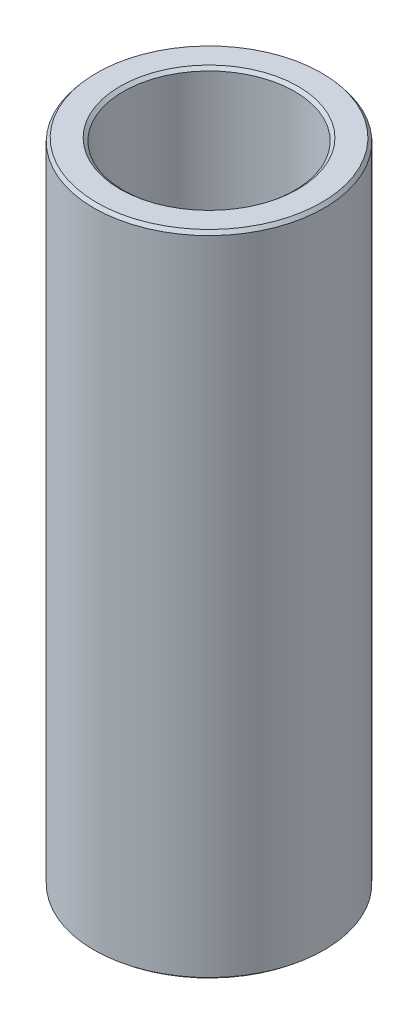
ISO-10303-21;
HEADER;
FILE_DESCRIPTION(('STEP AP214'),'2;1');
FILE_NAME('part.step','',(''),(''),'','','');
FILE_SCHEMA(('AUTOMOTIVE_DESIGN { 1 0 10303 214 1 1 1 1 }'));
ENDSEC;
DATA;
#1=APPLICATION_CONTEXT('core data for automotive mechanical design processes');
#2=APPLICATION_PROTOCOL_DEFINITION('international standard','automotive_design',2000,#1);
#3=PRODUCT_CONTEXT('',#1,'mechanical');
#4=PRODUCT('Part','Part','',(#3));
#5=PRODUCT_RELATED_PRODUCT_CATEGORY('part','',(#4));
#6=PRODUCT_DEFINITION_FORMATION('','',#4);
#7=PRODUCT_DEFINITION_CONTEXT('part definition',#1,'design');
#8=PRODUCT_DEFINITION('design','',#6,#7);
#9=PRODUCT_DEFINITION_SHAPE('','',#8);
#10=(LENGTH_UNIT() NAMED_UNIT(*) SI_UNIT(.MILLI.,.METRE.));
#11=(NAMED_UNIT(*) PLANE_ANGLE_UNIT() SI_UNIT($,.RADIAN.));
#12=(NAMED_UNIT(*) SI_UNIT($,.STERADIAN.) SOLID_ANGLE_UNIT());
#13=UNCERTAINTY_MEASURE_WITH_UNIT(LENGTH_MEASURE(1.E-05),#10,'distance_accuracy_value','');
#14=(GEOMETRIC_REPRESENTATION_CONTEXT(3) GLOBAL_UNCERTAINTY_ASSIGNED_CONTEXT((#13)) GLOBAL_UNIT_ASSIGNED_CONTEXT((#10,
#11,#12)) REPRESENTATION_CONTEXT('',''));
#15=CARTESIAN_POINT('',(0.,0.,0.));
#16=DIRECTION('',(0.,0.,1.));
#17=DIRECTION('',(1.,0.,0.));
#18=AXIS2_PLACEMENT_3D('',#15,#16,#17);
#19=CARTESIAN_POINT('',(0.,169.010100024157,0.));
#20=DIRECTION('',(0.,-1.,0.));
#21=DIRECTION('',(0.,0.,-1.));
#22=AXIS2_PLACEMENT_3D('',#19,#20,#21);
#23=CYLINDRICAL_SURFACE('',#22,30.);
#24=CARTESIAN_POINT('',(0.,0.720945809896067,0.));
#25=DIRECTION('',(0.,1.,0.));
#26=DIRECTION('',(0.,0.,1.));
#27=AXIS2_PLACEMENT_3D('',#24,#25,#26);
#28=CIRCLE('',#27,30.);
#29=CARTESIAN_POINT('',(0.,0.720945809896067,30.));
#30=VERTEX_POINT('',#29);
#31=EDGE_CURVE('E10',#30,#30,#28,.T.);
#32=ORIENTED_EDGE('',*,*,#31,.T.);
#33=EDGE_LOOP('',(#32));
#34=FACE_BOUND('',#33,.T.);
#35=CARTESIAN_POINT('',(0.,168.134085428879,0.));
#36=DIRECTION('',(0.,1.,0.));
#37=DIRECTION('',(0.,0.,1.));
#38=AXIS2_PLACEMENT_3D('',#35,#36,#37);
#39=CIRCLE('',#38,30.);
#40=CARTESIAN_POINT('',(0.,168.134085428879,30.));
#41=VERTEX_POINT('',#40);
#42=EDGE_CURVE('E50',#41,#41,#39,.F.);
#43=ORIENTED_EDGE('',*,*,#42,.T.);
#44=EDGE_LOOP('',(#43));
#45=FACE_BOUND('',#44,.T.);
#46=ADVANCED_FACE('F39',(#34,#45),#23,.T.);
#47=CARTESIAN_POINT('',(0.,169.010100024157,0.));
#48=DIRECTION('',(0.,1.,0.));
#49=DIRECTION('',(0.,0.,1.));
#50=AXIS2_PLACEMENT_3D('',#47,#48,#49);
#51=PLANE('',#50);
#52=CARTESIAN_POINT('',(0.,169.010100024157,0.));
#53=DIRECTION('',(0.,1.,0.));
#54=DIRECTION('',(0.,0.,1.));
#55=AXIS2_PLACEMENT_3D('',#52,#53,#54);
#56=CIRCLE('',#55,23.2012955524735);
#57=CARTESIAN_POINT('',(0.,169.010100024157,23.2012955524735));
#58=VERTEX_POINT('',#57);
#59=EDGE_CURVE('E58',#58,#58,#56,.F.);
#60=ORIENTED_EDGE('',*,*,#59,.T.);
#61=EDGE_LOOP('',(#60));
#62=FACE_BOUND('',#61,.T.);
#63=CARTESIAN_POINT('',(0.,169.010100024157,0.));
#64=DIRECTION('',(0.,1.,0.));
#65=DIRECTION('',(0.,0.,1.));
#66=AXIS2_PLACEMENT_3D('',#63,#64,#65);
#67=CIRCLE('',#66,29.2790541901039);
#68=CARTESIAN_POINT('',(0.,169.010100024157,29.2790541901039));
#69=VERTEX_POINT('',#68);
#70=EDGE_CURVE('E61',#69,#69,#67,.T.);
#71=ORIENTED_EDGE('',*,*,#70,.T.);
#72=EDGE_LOOP('',(#71));
#73=FACE_BOUND('',#72,.T.);
#74=ADVANCED_FACE('F88',(#62,#73),#51,.T.);
#75=CARTESIAN_POINT('',(0.,0.,0.));
#76=DIRECTION('',(0.,1.,0.));
#77=DIRECTION('',(0.,0.,1.));
#78=AXIS2_PLACEMENT_3D('',#75,#76,#77);
#79=PLANE('',#78);
#80=CARTESIAN_POINT('',(0.,0.,0.));
#81=DIRECTION('',(0.,1.,0.));
#82=DIRECTION('',(0.,0.,1.));
#83=AXIS2_PLACEMENT_3D('',#80,#81,#82);
#84=CIRCLE('',#83,23.0462267670917);
#85=CARTESIAN_POINT('',(0.,0.,23.0462267670917));
#86=VERTEX_POINT('',#85);
#87=EDGE_CURVE('E51',#86,#86,#84,.T.);
#88=ORIENTED_EDGE('',*,*,#87,.T.);
#89=EDGE_LOOP('',(#88));
#90=FACE_BOUND('',#89,.T.);
#91=CARTESIAN_POINT('',(0.,0.,0.));
#92=DIRECTION('',(0.,1.,0.));
#93=DIRECTION('',(0.,0.,1.));
#94=AXIS2_PLACEMENT_3D('',#91,#92,#93);
#95=CIRCLE('',#94,29.1239854047222);
#96=CARTESIAN_POINT('',(0.,0.,29.1239854047222));
#97=VERTEX_POINT('',#96);
#98=EDGE_CURVE('E54',#97,#97,#95,.F.);
#99=ORIENTED_EDGE('',*,*,#98,.T.);
#100=EDGE_LOOP('',(#99));
#101=FACE_BOUND('',#100,.T.);
#102=ADVANCED_FACE('F83',(#90,#101),#79,.F.);
#103=CARTESIAN_POINT('',(0.,169.010100024157,0.));
#104=DIRECTION('',(0.,-1.,0.));
#105=DIRECTION('',(0.,0.,-1.));
#106=AXIS2_PLACEMENT_3D('',#103,#104,#105);
#107=CYLINDRICAL_SURFACE('',#106,22.3252809571957);
#108=CARTESIAN_POINT('',(0.,168.289154214261,0.));
#109=DIRECTION('',(0.,1.,0.));
#110=DIRECTION('',(0.,0.,1.));
#111=AXIS2_PLACEMENT_3D('',#108,#109,#110);
#112=CIRCLE('',#111,22.3252809571957);
#113=CARTESIAN_POINT('',(0.,168.289154214261,22.3252809571957));
#114=VERTEX_POINT('',#113);
#115=EDGE_CURVE('E67',#114,#114,#112,.T.);
#116=ORIENTED_EDGE('',*,*,#115,.T.);
#117=EDGE_LOOP('',(#116));
#118=FACE_BOUND('',#117,.T.);
#119=CARTESIAN_POINT('',(0.,0.876014595277808,0.));
#120=DIRECTION('',(0.,1.,0.));
#121=DIRECTION('',(0.,0.,1.));
#122=AXIS2_PLACEMENT_3D('',#119,#120,#121);
#123=CIRCLE('',#122,22.3252809571957);
#124=CARTESIAN_POINT('',(0.,0.876014595277808,22.3252809571957));
#125=VERTEX_POINT('',#124);
#126=EDGE_CURVE('E69',#125,#125,#123,.F.);
#127=ORIENTED_EDGE('',*,*,#126,.T.);
#128=EDGE_LOOP('',(#127));
#129=FACE_BOUND('',#128,.T.);
#130=ADVANCED_FACE('F71',(#118,#129),#107,.F.);
#131=CARTESIAN_POINT('',(0.,168.289154214261,0.));
#132=DIRECTION('',(0.,1.,0.));
#133=DIRECTION('',(0.,0.,1.));
#134=AXIS2_PLACEMENT_3D('',#131,#132,#133);
#135=CONICAL_SURFACE('',#134,22.3252809571957,0.882197149954553);
#136=ORIENTED_EDGE('',*,*,#59,.F.);
#137=EDGE_LOOP('',(#136));
#138=FACE_BOUND('',#137,.T.);
#139=ORIENTED_EDGE('',*,*,#115,.F.);
#140=EDGE_LOOP('',(#139));
#141=FACE_BOUND('',#140,.T.);
#142=ADVANCED_FACE('F77',(#138,#141),#135,.F.);
#143=CARTESIAN_POINT('',(0.,0.,0.));
#144=DIRECTION('',(0.,-1.,0.));
#145=DIRECTION('',(0.,0.,-1.));
#146=AXIS2_PLACEMENT_3D('',#143,#144,#145);
#147=CONICAL_SURFACE('',#146,23.0462267670917,0.688599176840337);
#148=ORIENTED_EDGE('',*,*,#126,.F.);
#149=EDGE_LOOP('',(#148));
#150=FACE_BOUND('',#149,.T.);
#151=ORIENTED_EDGE('',*,*,#87,.F.);
#152=EDGE_LOOP('',(#151));
#153=FACE_BOUND('',#152,.T.);
#154=ADVANCED_FACE('F73',(#150,#153),#147,.F.);
#155=CARTESIAN_POINT('',(0.,0.720945809896067,0.));
#156=DIRECTION('',(0.,1.,0.));
#157=DIRECTION('',(0.,0.,1.));
#158=AXIS2_PLACEMENT_3D('',#155,#156,#157);
#159=CONICAL_SURFACE('',#158,30.,0.882197149954552);
#160=ORIENTED_EDGE('',*,*,#98,.F.);
#161=EDGE_LOOP('',(#160));
#162=FACE_BOUND('',#161,.T.);
#163=ORIENTED_EDGE('',*,*,#31,.F.);
#164=EDGE_LOOP('',(#163));
#165=FACE_BOUND('',#164,.T.);
#166=ADVANCED_FACE('F76',(#162,#165),#159,.T.);
#167=CARTESIAN_POINT('',(0.,169.010100024157,0.));
#168=DIRECTION('',(0.,-1.,0.));
#169=DIRECTION('',(0.,0.,-1.));
#170=AXIS2_PLACEMENT_3D('',#167,#168,#169);
#171=CONICAL_SURFACE('',#170,29.2790541901039,0.688599176840347);
#172=ORIENTED_EDGE('',*,*,#42,.F.);
#173=EDGE_LOOP('',(#172));
#174=FACE_BOUND('',#173,.T.);
#175=ORIENTED_EDGE('',*,*,#70,.F.);
#176=EDGE_LOOP('',(#175));
#177=FACE_BOUND('',#176,.T.);
#178=ADVANCED_FACE('F45',(#174,#177),#171,.T.);
#179=CLOSED_SHELL('',(#46,#74,#102,#130,#142,#154,#166,#178));
#180=MANIFOLD_SOLID_BREP('B2',#179);
#181=ADVANCED_BREP_SHAPE_REPRESENTATION('',(#18,#180),#14);
#182=SHAPE_DEFINITION_REPRESENTATION(#9,#181);
ENDSEC;
END-ISO-10303-21;
